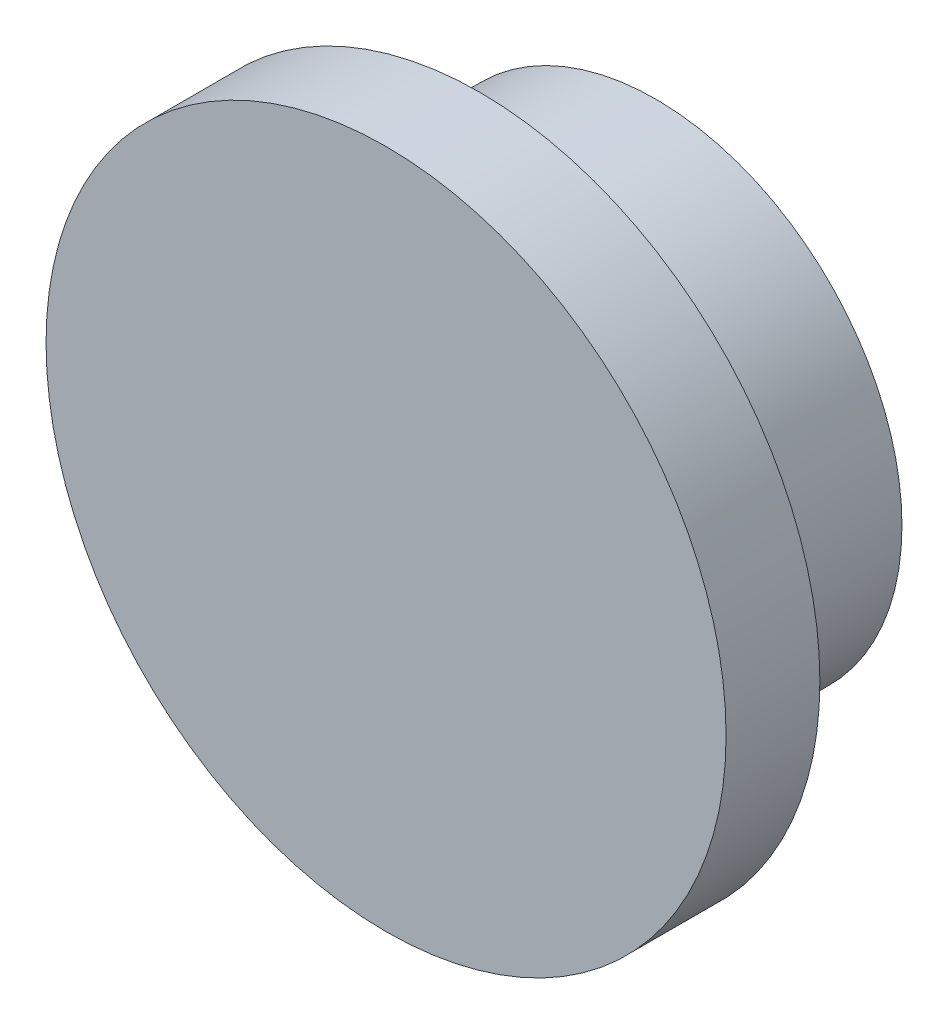
ISO-10303-21;
HEADER;
FILE_DESCRIPTION(('STEP AP214'),'2;1');
FILE_NAME('part.step','',(''),(''),'','','');
FILE_SCHEMA(('AUTOMOTIVE_DESIGN { 1 0 10303 214 1 1 1 1 }'));
ENDSEC;
DATA;
#1=APPLICATION_CONTEXT('core data for automotive mechanical design processes');
#2=APPLICATION_PROTOCOL_DEFINITION('international standard','automotive_design',2000,#1);
#3=PRODUCT_CONTEXT('',#1,'mechanical');
#4=PRODUCT('Part','Part','',(#3));
#5=PRODUCT_RELATED_PRODUCT_CATEGORY('part','',(#4));
#6=PRODUCT_DEFINITION_FORMATION('','',#4);
#7=PRODUCT_DEFINITION_CONTEXT('part definition',#1,'design');
#8=PRODUCT_DEFINITION('design','',#6,#7);
#9=PRODUCT_DEFINITION_SHAPE('','',#8);
#10=(LENGTH_UNIT() NAMED_UNIT(*) SI_UNIT(.MILLI.,.METRE.));
#11=(NAMED_UNIT(*) PLANE_ANGLE_UNIT() SI_UNIT($,.RADIAN.));
#12=(NAMED_UNIT(*) SI_UNIT($,.STERADIAN.) SOLID_ANGLE_UNIT());
#13=UNCERTAINTY_MEASURE_WITH_UNIT(LENGTH_MEASURE(1.E-05),#10,'distance_accuracy_value','');
#14=(GEOMETRIC_REPRESENTATION_CONTEXT(3) GLOBAL_UNCERTAINTY_ASSIGNED_CONTEXT((#13)) GLOBAL_UNIT_ASSIGNED_CONTEXT((#10,
#11,#12)) REPRESENTATION_CONTEXT('',''));
#15=CARTESIAN_POINT('',(0.,0.,0.));
#16=DIRECTION('',(0.,0.,1.));
#17=DIRECTION('',(1.,0.,0.));
#18=AXIS2_PLACEMENT_3D('',#15,#16,#17);
#19=CARTESIAN_POINT('',(0.,0.,2.54));
#20=DIRECTION('',(0.,0.,-1.));
#21=DIRECTION('',(-1.,0.,0.));
#22=AXIS2_PLACEMENT_3D('',#19,#20,#21);
#23=CYLINDRICAL_SURFACE('',#22,9.2075);
#24=CARTESIAN_POINT('',(0.,0.,2.54));
#25=DIRECTION('',(0.,0.,1.));
#26=DIRECTION('',(1.,0.,0.));
#27=AXIS2_PLACEMENT_3D('',#24,#25,#26);
#28=CIRCLE('',#27,9.2075);
#29=CARTESIAN_POINT('',(9.2075,0.,2.54));
#30=VERTEX_POINT('',#29);
#31=EDGE_CURVE('E41',#30,#30,#28,.T.);
#32=ORIENTED_EDGE('',*,*,#31,.F.);
#33=EDGE_LOOP('',(#32));
#34=FACE_BOUND('',#33,.T.);
#35=CARTESIAN_POINT('',(0.,0.,0.));
#36=DIRECTION('',(0.,0.,1.));
#37=DIRECTION('',(1.,0.,0.));
#38=AXIS2_PLACEMENT_3D('',#35,#36,#37);
#39=CIRCLE('',#38,9.2075);
#40=CARTESIAN_POINT('',(9.2075,0.,0.));
#41=VERTEX_POINT('',#40);
#42=EDGE_CURVE('E48',#41,#41,#39,.T.);
#43=ORIENTED_EDGE('',*,*,#42,.T.);
#44=EDGE_LOOP('',(#43));
#45=FACE_BOUND('',#44,.T.);
#46=ADVANCED_FACE('F34',(#34,#45),#23,.T.);
#47=CARTESIAN_POINT('',(0.,0.,2.54));
#48=DIRECTION('',(0.,0.,1.));
#49=DIRECTION('',(1.,0.,0.));
#50=AXIS2_PLACEMENT_3D('',#47,#48,#49);
#51=PLANE('',#50);
#52=ORIENTED_EDGE('',*,*,#31,.T.);
#53=EDGE_LOOP('',(#52));
#54=FACE_BOUND('',#53,.T.);
#55=ADVANCED_FACE('F84',(#54),#51,.T.);
#56=CARTESIAN_POINT('',(0.,0.,0.));
#57=DIRECTION('',(0.,0.,1.));
#58=DIRECTION('',(1.,0.,0.));
#59=AXIS2_PLACEMENT_3D('',#56,#57,#58);
#60=PLANE('',#59);
#61=CARTESIAN_POINT('',(0.,0.,0.));
#62=DIRECTION('',(0.,0.,1.));
#63=DIRECTION('',(1.,0.,0.));
#64=AXIS2_PLACEMENT_3D('',#61,#62,#63);
#65=CIRCLE('',#64,6.6675);
#66=CARTESIAN_POINT('',(6.6675,0.,0.));
#67=VERTEX_POINT('',#66);
#68=EDGE_CURVE('E10',#67,#67,#65,.F.);
#69=ORIENTED_EDGE('',*,*,#68,.F.);
#70=EDGE_LOOP('',(#69));
#71=FACE_BOUND('',#70,.T.);
#72=ORIENTED_EDGE('',*,*,#42,.F.);
#73=EDGE_LOOP('',(#72));
#74=FACE_BOUND('',#73,.T.);
#75=ADVANCED_FACE('F79',(#71,#74),#60,.F.);
#76=CARTESIAN_POINT('',(0.,0.,-23.6210378542452));
#77=DIRECTION('',(0.,0.,1.));
#78=DIRECTION('',(1.,0.,0.));
#79=AXIS2_PLACEMENT_3D('',#76,#77,#78);
#80=CYLINDRICAL_SURFACE('',#79,6.6675);
#81=ORIENTED_EDGE('',*,*,#68,.T.);
#82=EDGE_LOOP('',(#81));
#83=FACE_BOUND('',#82,.T.);
#84=CARTESIAN_POINT('',(0.,0.,-4.7625));
#85=DIRECTION('',(0.,0.,1.));
#86=DIRECTION('',(0.546944138603989,0.837169104331222,0.));
#87=AXIS2_PLACEMENT_3D('',#84,#85,#86);
#88=CIRCLE('',#87,6.6675);
#89=CARTESIAN_POINT('',(3.64675004414209,5.58182500312842,-4.7625));
#90=VERTEX_POINT('',#89);
#91=EDGE_CURVE('E55',#90,#90,#88,.T.);
#92=ORIENTED_EDGE('',*,*,#91,.T.);
#93=EDGE_LOOP('',(#92));
#94=FACE_BOUND('',#93,.T.);
#95=ADVANCED_FACE('F66',(#83,#94),#80,.T.);
#96=CARTESIAN_POINT('',(0.,0.,-23.6210378542452));
#97=DIRECTION('',(0.,0.,1.));
#98=DIRECTION('',(1.,0.,0.));
#99=AXIS2_PLACEMENT_3D('',#96,#97,#98);
#100=CYLINDRICAL_SURFACE('',#99,4.8895);
#101=CARTESIAN_POINT('',(0.,0.,0.));
#102=DIRECTION('',(0.,0.,-1.));
#103=DIRECTION('',(-1.,0.,0.));
#104=AXIS2_PLACEMENT_3D('',#101,#102,#103);
#105=CIRCLE('',#104,4.8895);
#106=CARTESIAN_POINT('',(-4.8895,0.,0.));
#107=VERTEX_POINT('',#106);
#108=EDGE_CURVE('E60',#107,#107,#105,.T.);
#109=ORIENTED_EDGE('',*,*,#108,.F.);
#110=EDGE_LOOP('',(#109));
#111=FACE_BOUND('',#110,.T.);
#112=CARTESIAN_POINT('',(0.,0.,-4.7625));
#113=DIRECTION('',(0.,0.,-1.));
#114=DIRECTION('',(-1.,0.,0.));
#115=AXIS2_PLACEMENT_3D('',#112,#113,#114);
#116=CIRCLE('',#115,4.8895);
#117=CARTESIAN_POINT('',(-4.8895,0.,-4.7625));
#118=VERTEX_POINT('',#117);
#119=EDGE_CURVE('E57',#118,#118,#116,.T.);
#120=ORIENTED_EDGE('',*,*,#119,.T.);
#121=EDGE_LOOP('',(#120));
#122=FACE_BOUND('',#121,.T.);
#123=ADVANCED_FACE('F71',(#111,#122),#100,.F.);
#124=CARTESIAN_POINT('',(1.91376857250117,-1.25031430084872,-4.7625));
#125=DIRECTION('',(0.,0.,-1.));
#126=DIRECTION('',(-0.546944138603989,-0.837169104331222,0.));
#127=AXIS2_PLACEMENT_3D('',#124,#125,#126);
#128=PLANE('',#127);
#129=ORIENTED_EDGE('',*,*,#119,.F.);
#130=EDGE_LOOP('',(#129));
#131=FACE_BOUND('',#130,.T.);
#132=ORIENTED_EDGE('',*,*,#91,.F.);
#133=EDGE_LOOP('',(#132));
#134=FACE_BOUND('',#133,.T.);
#135=ADVANCED_FACE('F68',(#131,#134),#128,.T.);
#136=ORIENTED_EDGE('',*,*,#108,.T.);
#137=EDGE_LOOP('',(#136));
#138=FACE_BOUND('',#137,.T.);
#139=ADVANCED_FACE('F70',(#138),#60,.F.);
#140=CLOSED_SHELL('',(#46,#55,#75,#95,#123,#135,#139));
#141=MANIFOLD_SOLID_BREP('B2',#140);
#142=ADVANCED_BREP_SHAPE_REPRESENTATION('',(#18,#141),#14);
#143=SHAPE_DEFINITION_REPRESENTATION(#9,#142);
ENDSEC;
END-ISO-10303-21;
